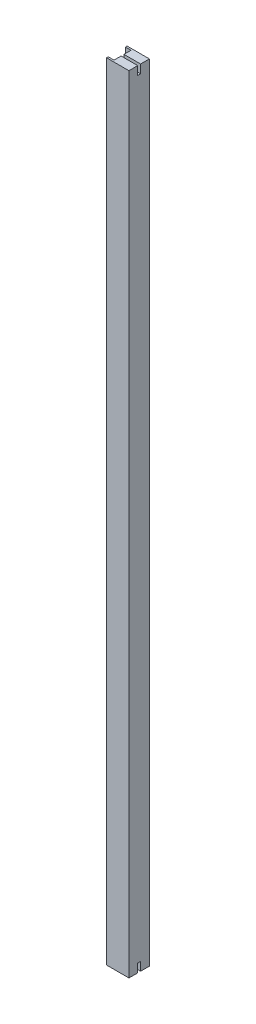
ISO-10303-21;
HEADER;
FILE_DESCRIPTION(('STEP AP214'),'2;1');
FILE_NAME('part.step','',(''),(''),'','','');
FILE_SCHEMA(('AUTOMOTIVE_DESIGN { 1 0 10303 214 1 1 1 1 }'));
ENDSEC;
DATA;
#1=APPLICATION_CONTEXT('core data for automotive mechanical design processes');
#2=APPLICATION_PROTOCOL_DEFINITION('international standard','automotive_design',2000,#1);
#3=PRODUCT_CONTEXT('',#1,'mechanical');
#4=PRODUCT('Part','Part','',(#3));
#5=PRODUCT_RELATED_PRODUCT_CATEGORY('part','',(#4));
#6=PRODUCT_DEFINITION_FORMATION('','',#4);
#7=PRODUCT_DEFINITION_CONTEXT('part definition',#1,'design');
#8=PRODUCT_DEFINITION('design','',#6,#7);
#9=PRODUCT_DEFINITION_SHAPE('','',#8);
#10=(LENGTH_UNIT() NAMED_UNIT(*) SI_UNIT(.MILLI.,.METRE.));
#11=(NAMED_UNIT(*) PLANE_ANGLE_UNIT() SI_UNIT($,.RADIAN.));
#12=(NAMED_UNIT(*) SI_UNIT($,.STERADIAN.) SOLID_ANGLE_UNIT());
#13=UNCERTAINTY_MEASURE_WITH_UNIT(LENGTH_MEASURE(1.E-05),#10,'distance_accuracy_value','');
#14=(GEOMETRIC_REPRESENTATION_CONTEXT(3) GLOBAL_UNCERTAINTY_ASSIGNED_CONTEXT((#13)) GLOBAL_UNIT_ASSIGNED_CONTEXT((#10,
#11,#12)) REPRESENTATION_CONTEXT('',''));
#15=CARTESIAN_POINT('',(0.,0.,0.));
#16=DIRECTION('',(0.,0.,1.));
#17=DIRECTION('',(1.,0.,0.));
#18=AXIS2_PLACEMENT_3D('',#15,#16,#17);
#19=CARTESIAN_POINT('',(0.,1383.55,0.));
#20=DIRECTION('',(0.,-1.,0.));
#21=DIRECTION('',(0.,0.,-1.));
#22=AXIS2_PLACEMENT_3D('',#19,#20,#21);
#23=PLANE('',#22);
#24=DIRECTION('',(0.,0.,1.));
#25=VECTOR('',#24,1.);
#26=CARTESIAN_POINT('',(10.,1383.55,-2.5));
#27=LINE('',#26,#25);
#28=CARTESIAN_POINT('',(10.,1383.55,-15.));
#29=VERTEX_POINT('',#28);
#30=CARTESIAN_POINT('',(10.,1383.55,-2.49999999999983));
#31=VERTEX_POINT('',#30);
#32=EDGE_CURVE('E145',#29,#31,#27,.T.);
#33=ORIENTED_EDGE('',*,*,#32,.T.);
#34=DIRECTION('',(1.,0.,0.));
#35=VECTOR('',#34,1.);
#36=CARTESIAN_POINT('',(0.,1383.55,-2.49999999999983));
#37=LINE('',#36,#35);
#38=CARTESIAN_POINT('',(39.2552066704881,1383.55,-2.49999999999983));
#39=VERTEX_POINT('',#38);
#40=EDGE_CURVE('E11',#31,#39,#37,.T.);
#41=ORIENTED_EDGE('',*,*,#40,.T.);
#42=DIRECTION('',(0.,0.,-1.));
#43=VECTOR('',#42,1.);
#44=CARTESIAN_POINT('',(39.2552066704881,1383.55,-18.));
#45=LINE('',#44,#43);
#46=CARTESIAN_POINT('',(39.2552066704881,1383.55,-18.));
#47=VERTEX_POINT('',#46);
#48=EDGE_CURVE('E127',#39,#47,#45,.T.);
#49=ORIENTED_EDGE('',*,*,#48,.T.);
#50=DIRECTION('',(-1.,0.,0.));
#51=VECTOR('',#50,1.);
#52=CARTESIAN_POINT('',(0.,1383.55,-18.));
#53=LINE('',#52,#51);
#54=CARTESIAN_POINT('',(0.,1383.55,-18.));
#55=VERTEX_POINT('',#54);
#56=EDGE_CURVE('E121',#47,#55,#53,.T.);
#57=ORIENTED_EDGE('',*,*,#56,.T.);
#58=DIRECTION('',(0.,0.,1.));
#59=VECTOR('',#58,1.);
#60=CARTESIAN_POINT('',(0.,1383.55,-15.));
#61=LINE('',#60,#59);
#62=CARTESIAN_POINT('',(0.,1383.55,-15.));
#63=VERTEX_POINT('',#62);
#64=EDGE_CURVE('E124',#55,#63,#61,.T.);
#65=ORIENTED_EDGE('',*,*,#64,.T.);
#66=DIRECTION('',(1.,0.,0.));
#67=VECTOR('',#66,1.);
#68=CARTESIAN_POINT('',(10.,1383.55,-15.));
#69=LINE('',#68,#67);
#70=EDGE_CURVE('E52',#63,#29,#69,.T.);
#71=ORIENTED_EDGE('',*,*,#70,.T.);
#72=EDGE_LOOP('',(#33,#41,#49,#57,#65,#71));
#73=FACE_BOUND('',#72,.T.);
#74=ADVANCED_FACE('F35',(#73),#23,.F.);
#75=CARTESIAN_POINT('',(0.,0.,0.));
#76=DIRECTION('',(0.,-1.,0.));
#77=DIRECTION('',(0.,0.,-1.));
#78=AXIS2_PLACEMENT_3D('',#75,#76,#77);
#79=PLANE('',#78);
#80=DIRECTION('',(-1.,0.,0.));
#81=VECTOR('',#80,1.);
#82=CARTESIAN_POINT('',(0.,0.,2.5));
#83=LINE('',#82,#81);
#84=CARTESIAN_POINT('',(39.2552066704881,0.,2.5));
#85=VERTEX_POINT('',#84);
#86=CARTESIAN_POINT('',(10.,0.,2.5));
#87=VERTEX_POINT('',#86);
#88=EDGE_CURVE('E201',#85,#87,#83,.T.);
#89=ORIENTED_EDGE('',*,*,#88,.F.);
#90=DIRECTION('',(0.,0.,-1.));
#91=VECTOR('',#90,1.);
#92=CARTESIAN_POINT('',(39.2552066704881,0.,-18.));
#93=LINE('',#92,#91);
#94=CARTESIAN_POINT('',(39.2552066704881,0.,18.));
#95=VERTEX_POINT('',#94);
#96=EDGE_CURVE('E161',#95,#85,#93,.T.);
#97=ORIENTED_EDGE('',*,*,#96,.F.);
#98=DIRECTION('',(1.,0.,0.));
#99=VECTOR('',#98,1.);
#100=CARTESIAN_POINT('',(0.,0.,18.));
#101=LINE('',#100,#99);
#102=CARTESIAN_POINT('',(0.,0.,18.));
#103=VERTEX_POINT('',#102);
#104=EDGE_CURVE('E158',#103,#95,#101,.T.);
#105=ORIENTED_EDGE('',*,*,#104,.F.);
#106=DIRECTION('',(0.,0.,1.));
#107=VECTOR('',#106,1.);
#108=CARTESIAN_POINT('',(0.,0.,15.));
#109=LINE('',#108,#107);
#110=CARTESIAN_POINT('',(0.,0.,15.));
#111=VERTEX_POINT('',#110);
#112=EDGE_CURVE('E156',#111,#103,#109,.T.);
#113=ORIENTED_EDGE('',*,*,#112,.F.);
#114=DIRECTION('',(-1.,0.,0.));
#115=VECTOR('',#114,1.);
#116=CARTESIAN_POINT('',(10.,0.,15.));
#117=LINE('',#116,#115);
#118=CARTESIAN_POINT('',(10.,0.,15.));
#119=VERTEX_POINT('',#118);
#120=EDGE_CURVE('E153',#119,#111,#117,.T.);
#121=ORIENTED_EDGE('',*,*,#120,.F.);
#122=DIRECTION('',(0.,0.,1.));
#123=VECTOR('',#122,1.);
#124=CARTESIAN_POINT('',(10.,0.,2.5));
#125=LINE('',#124,#123);
#126=EDGE_CURVE('E151',#87,#119,#125,.T.);
#127=ORIENTED_EDGE('',*,*,#126,.F.);
#128=EDGE_LOOP('',(#89,#97,#105,#113,#121,#127));
#129=FACE_BOUND('',#128,.T.);
#130=ADVANCED_FACE('F357',(#129),#79,.T.);
#131=CARTESIAN_POINT('',(0.,1383.55,-2.5));
#132=DIRECTION('',(1.,0.,0.));
#133=DIRECTION('',(0.,0.,-1.));
#134=AXIS2_PLACEMENT_3D('',#131,#132,#133);
#135=PLANE('',#134);
#136=DIRECTION('',(0.,-1.,0.));
#137=VECTOR('',#136,1.);
#138=CARTESIAN_POINT('',(0.,1383.55,-2.5));
#139=LINE('',#138,#137);
#140=CARTESIAN_POINT('',(0.,1368.55,-2.49999999999983));
#141=VERTEX_POINT('',#140);
#142=CARTESIAN_POINT('',(0.,15.,-2.5));
#143=VERTEX_POINT('',#142);
#144=EDGE_CURVE('E150',#141,#143,#139,.T.);
#145=ORIENTED_EDGE('',*,*,#144,.T.);
#146=DIRECTION('',(0.,0.,1.));
#147=VECTOR('',#146,1.);
#148=CARTESIAN_POINT('',(0.,15.,2.5));
#149=LINE('',#148,#147);
#150=CARTESIAN_POINT('',(0.,15.,2.5));
#151=VERTEX_POINT('',#150);
#152=EDGE_CURVE('E284',#143,#151,#149,.T.);
#153=ORIENTED_EDGE('',*,*,#152,.T.);
#154=DIRECTION('',(0.,-1.,0.));
#155=VECTOR('',#154,1.);
#156=CARTESIAN_POINT('',(0.,1383.55,2.5));
#157=LINE('',#156,#155);
#158=CARTESIAN_POINT('',(0.,1368.55,2.49999999999983));
#159=VERTEX_POINT('',#158);
#160=EDGE_CURVE('E196',#159,#151,#157,.T.);
#161=ORIENTED_EDGE('',*,*,#160,.F.);
#162=DIRECTION('',(0.,0.,-1.));
#163=VECTOR('',#162,1.);
#164=CARTESIAN_POINT('',(0.,1368.55,2.49999999999983));
#165=LINE('',#164,#163);
#166=EDGE_CURVE('E247',#159,#141,#165,.T.);
#167=ORIENTED_EDGE('',*,*,#166,.T.);
#168=EDGE_LOOP('',(#145,#153,#161,#167));
#169=FACE_BOUND('',#168,.T.);
#170=ADVANCED_FACE('F37',(#169),#135,.F.);
#171=CARTESIAN_POINT('',(10.,1383.55,2.5));
#172=DIRECTION('',(0.,0.,-1.));
#173=DIRECTION('',(-1.,0.,0.));
#174=AXIS2_PLACEMENT_3D('',#171,#172,#173);
#175=PLANE('',#174);
#176=ORIENTED_EDGE('',*,*,#160,.T.);
#177=DIRECTION('',(1.,0.,0.));
#178=VECTOR('',#177,1.);
#179=CARTESIAN_POINT('',(0.,15.,2.5));
#180=LINE('',#179,#178);
#181=CARTESIAN_POINT('',(10.,15.,2.5));
#182=VERTEX_POINT('',#181);
#183=EDGE_CURVE('E260',#151,#182,#180,.T.);
#184=ORIENTED_EDGE('',*,*,#183,.T.);
#185=DIRECTION('',(0.,-1.,0.));
#186=VECTOR('',#185,1.);
#187=CARTESIAN_POINT('',(10.,1383.55,2.5));
#188=LINE('',#187,#186);
#189=CARTESIAN_POINT('',(10.,1368.55,2.49999999999983));
#190=VERTEX_POINT('',#189);
#191=EDGE_CURVE('E194',#190,#182,#188,.T.);
#192=ORIENTED_EDGE('',*,*,#191,.F.);
#193=DIRECTION('',(1.,0.,0.));
#194=VECTOR('',#193,1.);
#195=CARTESIAN_POINT('',(0.,1368.55,2.49999999999983));
#196=LINE('',#195,#194);
#197=EDGE_CURVE('E257',#159,#190,#196,.T.);
#198=ORIENTED_EDGE('',*,*,#197,.F.);
#199=EDGE_LOOP('',(#176,#184,#192,#198));
#200=FACE_BOUND('',#199,.T.);
#201=ADVANCED_FACE('F397',(#200),#175,.F.);
#202=CARTESIAN_POINT('',(10.,1383.55,2.5));
#203=DIRECTION('',(1.,0.,0.));
#204=DIRECTION('',(0.,0.,-1.));
#205=AXIS2_PLACEMENT_3D('',#202,#203,#204);
#206=PLANE('',#205);
#207=ORIENTED_EDGE('',*,*,#126,.T.);
#208=DIRECTION('',(0.,-1.,0.));
#209=VECTOR('',#208,1.);
#210=CARTESIAN_POINT('',(10.,1383.55,15.));
#211=LINE('',#210,#209);
#212=CARTESIAN_POINT('',(10.,1383.55,15.));
#213=VERTEX_POINT('',#212);
#214=EDGE_CURVE('E191',#213,#119,#211,.T.);
#215=ORIENTED_EDGE('',*,*,#214,.F.);
#216=DIRECTION('',(0.,0.,1.));
#217=VECTOR('',#216,1.);
#218=CARTESIAN_POINT('',(10.,1383.55,2.5));
#219=LINE('',#218,#217);
#220=CARTESIAN_POINT('',(10.,1383.55,2.5));
#221=VERTEX_POINT('',#220);
#222=EDGE_CURVE('E171',#221,#213,#219,.T.);
#223=ORIENTED_EDGE('',*,*,#222,.F.);
#224=EDGE_CURVE('E101',#221,#190,#188,.T.);
#225=ORIENTED_EDGE('',*,*,#224,.T.);
#226=ORIENTED_EDGE('',*,*,#191,.T.);
#227=DIRECTION('',(0.,-1.,0.));
#228=VECTOR('',#227,1.);
#229=CARTESIAN_POINT('',(10.,1383.55,2.5));
#230=LINE('',#229,#228);
#231=EDGE_CURVE('E154',#182,#87,#230,.T.);
#232=ORIENTED_EDGE('',*,*,#231,.T.);
#233=EDGE_LOOP('',(#207,#215,#223,#225,#226,#232));
#234=FACE_BOUND('',#233,.T.);
#235=ADVANCED_FACE('F213',(#234),#206,.F.);
#236=CARTESIAN_POINT('',(10.,1383.55,15.));
#237=DIRECTION('',(0.,0.,1.));
#238=DIRECTION('',(1.,0.,0.));
#239=AXIS2_PLACEMENT_3D('',#236,#237,#238);
#240=PLANE('',#239);
#241=ORIENTED_EDGE('',*,*,#120,.T.);
#242=DIRECTION('',(0.,-1.,0.));
#243=VECTOR('',#242,1.);
#244=CARTESIAN_POINT('',(0.,1383.55,15.));
#245=LINE('',#244,#243);
#246=CARTESIAN_POINT('',(0.,1383.55,15.));
#247=VERTEX_POINT('',#246);
#248=EDGE_CURVE('E188',#247,#111,#245,.T.);
#249=ORIENTED_EDGE('',*,*,#248,.F.);
#250=DIRECTION('',(-1.,0.,0.));
#251=VECTOR('',#250,1.);
#252=CARTESIAN_POINT('',(10.,1383.55,15.));
#253=LINE('',#252,#251);
#254=EDGE_CURVE('E217',#213,#247,#253,.T.);
#255=ORIENTED_EDGE('',*,*,#254,.F.);
#256=ORIENTED_EDGE('',*,*,#214,.T.);
#257=EDGE_LOOP('',(#241,#249,#255,#256));
#258=FACE_BOUND('',#257,.T.);
#259=ADVANCED_FACE('F391',(#258),#240,.F.);
#260=CARTESIAN_POINT('',(0.,1383.55,15.));
#261=DIRECTION('',(1.,0.,0.));
#262=DIRECTION('',(0.,0.,-1.));
#263=AXIS2_PLACEMENT_3D('',#260,#261,#262);
#264=PLANE('',#263);
#265=ORIENTED_EDGE('',*,*,#112,.T.);
#266=DIRECTION('',(0.,-1.,0.));
#267=VECTOR('',#266,1.);
#268=CARTESIAN_POINT('',(0.,1383.55,18.));
#269=LINE('',#268,#267);
#270=CARTESIAN_POINT('',(0.,1383.55,18.));
#271=VERTEX_POINT('',#270);
#272=EDGE_CURVE('E185',#271,#103,#269,.T.);
#273=ORIENTED_EDGE('',*,*,#272,.F.);
#274=DIRECTION('',(0.,0.,1.));
#275=VECTOR('',#274,1.);
#276=CARTESIAN_POINT('',(0.,1383.55,15.));
#277=LINE('',#276,#275);
#278=EDGE_CURVE('E219',#247,#271,#277,.T.);
#279=ORIENTED_EDGE('',*,*,#278,.F.);
#280=ORIENTED_EDGE('',*,*,#248,.T.);
#281=EDGE_LOOP('',(#265,#273,#279,#280));
#282=FACE_BOUND('',#281,.T.);
#283=ADVANCED_FACE('F388',(#282),#264,.F.);
#284=CARTESIAN_POINT('',(0.,1383.55,18.));
#285=DIRECTION('',(0.,0.,-1.));
#286=DIRECTION('',(-1.,0.,0.));
#287=AXIS2_PLACEMENT_3D('',#284,#285,#286);
#288=PLANE('',#287);
#289=ORIENTED_EDGE('',*,*,#104,.T.);
#290=DIRECTION('',(0.,-1.,0.));
#291=VECTOR('',#290,1.);
#292=CARTESIAN_POINT('',(39.2552066704881,1383.55,18.));
#293=LINE('',#292,#291);
#294=CARTESIAN_POINT('',(39.2552066704881,1383.55,18.));
#295=VERTEX_POINT('',#294);
#296=EDGE_CURVE('E182',#295,#95,#293,.T.);
#297=ORIENTED_EDGE('',*,*,#296,.F.);
#298=DIRECTION('',(1.,0.,0.));
#299=VECTOR('',#298,1.);
#300=CARTESIAN_POINT('',(0.,1383.55,18.));
#301=LINE('',#300,#299);
#302=EDGE_CURVE('E225',#271,#295,#301,.T.);
#303=ORIENTED_EDGE('',*,*,#302,.F.);
#304=ORIENTED_EDGE('',*,*,#272,.T.);
#305=EDGE_LOOP('',(#289,#297,#303,#304));
#306=FACE_BOUND('',#305,.T.);
#307=ADVANCED_FACE('F231',(#306),#288,.F.);
#308=CARTESIAN_POINT('',(39.2552066704881,1383.55,-18.));
#309=DIRECTION('',(-1.,0.,0.));
#310=DIRECTION('',(0.,0.,1.));
#311=AXIS2_PLACEMENT_3D('',#308,#309,#310);
#312=PLANE('',#311);
#313=ORIENTED_EDGE('',*,*,#96,.T.);
#314=DIRECTION('',(0.,-1.,0.));
#315=VECTOR('',#314,1.);
#316=CARTESIAN_POINT('',(39.2552066704881,0.,2.5));
#317=LINE('',#316,#315);
#318=CARTESIAN_POINT('',(39.2552066704881,15.,2.5));
#319=VERTEX_POINT('',#318);
#320=EDGE_CURVE('E255',#319,#85,#317,.T.);
#321=ORIENTED_EDGE('',*,*,#320,.F.);
#322=DIRECTION('',(0.,0.,1.));
#323=VECTOR('',#322,1.);
#324=CARTESIAN_POINT('',(39.2552066704881,15.,2.5));
#325=LINE('',#324,#323);
#326=CARTESIAN_POINT('',(39.2552066704881,15.,-2.5));
#327=VERTEX_POINT('',#326);
#328=EDGE_CURVE('E276',#327,#319,#325,.T.);
#329=ORIENTED_EDGE('',*,*,#328,.F.);
#330=DIRECTION('',(0.,1.,0.));
#331=VECTOR('',#330,1.);
#332=CARTESIAN_POINT('',(39.2552066704881,0.,-2.5));
#333=LINE('',#332,#331);
#334=CARTESIAN_POINT('',(39.2552066704881,0.,-2.5));
#335=VERTEX_POINT('',#334);
#336=EDGE_CURVE('E293',#335,#327,#333,.T.);
#337=ORIENTED_EDGE('',*,*,#336,.F.);
#338=CARTESIAN_POINT('',(39.2552066704881,0.,-18.));
#339=VERTEX_POINT('',#338);
#340=EDGE_CURVE('E160',#335,#339,#93,.T.);
#341=ORIENTED_EDGE('',*,*,#340,.T.);
#342=DIRECTION('',(0.,-1.,0.));
#343=VECTOR('',#342,1.);
#344=CARTESIAN_POINT('',(39.2552066704881,1383.55,-18.));
#345=LINE('',#344,#343);
#346=EDGE_CURVE('E140',#47,#339,#345,.T.);
#347=ORIENTED_EDGE('',*,*,#346,.F.);
#348=ORIENTED_EDGE('',*,*,#48,.F.);
#349=DIRECTION('',(0.,1.,0.));
#350=VECTOR('',#349,1.);
#351=CARTESIAN_POINT('',(39.2552066704881,1383.55,-2.49999999999983));
#352=LINE('',#351,#350);
#353=CARTESIAN_POINT('',(39.2552066704881,1368.55,-2.49999999999983));
#354=VERTEX_POINT('',#353);
#355=EDGE_CURVE('E244',#354,#39,#352,.T.);
#356=ORIENTED_EDGE('',*,*,#355,.F.);
#357=DIRECTION('',(0.,0.,-1.));
#358=VECTOR('',#357,1.);
#359=CARTESIAN_POINT('',(39.2552066704881,1368.55,2.49999999999983));
#360=LINE('',#359,#358);
#361=CARTESIAN_POINT('',(39.2552066704881,1368.55,2.49999999999983));
#362=VERTEX_POINT('',#361);
#363=EDGE_CURVE('E241',#362,#354,#360,.T.);
#364=ORIENTED_EDGE('',*,*,#363,.F.);
#365=DIRECTION('',(0.,-1.,0.));
#366=VECTOR('',#365,1.);
#367=CARTESIAN_POINT('',(39.2552066704881,1383.55,2.49999999999983));
#368=LINE('',#367,#366);
#369=CARTESIAN_POINT('',(39.2552066704881,1383.55,2.49999999999983));
#370=VERTEX_POINT('',#369);
#371=EDGE_CURVE('E237',#370,#362,#368,.T.);
#372=ORIENTED_EDGE('',*,*,#371,.F.);
#373=EDGE_CURVE('E131',#295,#370,#45,.T.);
#374=ORIENTED_EDGE('',*,*,#373,.F.);
#375=ORIENTED_EDGE('',*,*,#296,.T.);
#376=EDGE_LOOP('',(#313,#321,#329,#337,#341,#347,#348,#356,#364,#372,#374,#375));
#377=FACE_BOUND('',#376,.T.);
#378=ADVANCED_FACE('F235',(#377),#312,.F.);
#379=CARTESIAN_POINT('',(0.,1383.55,-18.));
#380=DIRECTION('',(0.,0.,1.));
#381=DIRECTION('',(1.,0.,0.));
#382=AXIS2_PLACEMENT_3D('',#379,#380,#381);
#383=PLANE('',#382);
#384=DIRECTION('',(-1.,0.,0.));
#385=VECTOR('',#384,1.);
#386=CARTESIAN_POINT('',(0.,0.,-18.));
#387=LINE('',#386,#385);
#388=CARTESIAN_POINT('',(0.,0.,-18.));
#389=VERTEX_POINT('',#388);
#390=EDGE_CURVE('E137',#339,#389,#387,.T.);
#391=ORIENTED_EDGE('',*,*,#390,.T.);
#392=DIRECTION('',(0.,-1.,0.));
#393=VECTOR('',#392,1.);
#394=CARTESIAN_POINT('',(0.,1383.55,-18.));
#395=LINE('',#394,#393);
#396=EDGE_CURVE('E134',#55,#389,#395,.T.);
#397=ORIENTED_EDGE('',*,*,#396,.F.);
#398=ORIENTED_EDGE('',*,*,#56,.F.);
#399=ORIENTED_EDGE('',*,*,#346,.T.);
#400=EDGE_LOOP('',(#391,#397,#398,#399));
#401=FACE_BOUND('',#400,.T.);
#402=ADVANCED_FACE('F135',(#401),#383,.F.);
#403=CARTESIAN_POINT('',(0.,1383.55,-15.));
#404=DIRECTION('',(1.,0.,0.));
#405=DIRECTION('',(0.,0.,-1.));
#406=AXIS2_PLACEMENT_3D('',#403,#404,#405);
#407=PLANE('',#406);
#408=DIRECTION('',(0.,0.,1.));
#409=VECTOR('',#408,1.);
#410=CARTESIAN_POINT('',(0.,0.,-15.));
#411=LINE('',#410,#409);
#412=CARTESIAN_POINT('',(0.,0.,-15.));
#413=VERTEX_POINT('',#412);
#414=EDGE_CURVE('E165',#389,#413,#411,.T.);
#415=ORIENTED_EDGE('',*,*,#414,.T.);
#416=DIRECTION('',(0.,-1.,0.));
#417=VECTOR('',#416,1.);
#418=CARTESIAN_POINT('',(0.,1383.55,-15.));
#419=LINE('',#418,#417);
#420=EDGE_CURVE('E141',#63,#413,#419,.T.);
#421=ORIENTED_EDGE('',*,*,#420,.F.);
#422=ORIENTED_EDGE('',*,*,#64,.F.);
#423=ORIENTED_EDGE('',*,*,#396,.T.);
#424=EDGE_LOOP('',(#415,#421,#422,#423));
#425=FACE_BOUND('',#424,.T.);
#426=ADVANCED_FACE('F143',(#425),#407,.F.);
#427=CARTESIAN_POINT('',(10.,1383.55,-15.));
#428=DIRECTION('',(0.,0.,-1.));
#429=DIRECTION('',(-1.,0.,0.));
#430=AXIS2_PLACEMENT_3D('',#427,#428,#429);
#431=PLANE('',#430);
#432=DIRECTION('',(1.,0.,0.));
#433=VECTOR('',#432,1.);
#434=CARTESIAN_POINT('',(10.,0.,-15.));
#435=LINE('',#434,#433);
#436=CARTESIAN_POINT('',(10.,0.,-15.));
#437=VERTEX_POINT('',#436);
#438=EDGE_CURVE('E84',#413,#437,#435,.T.);
#439=ORIENTED_EDGE('',*,*,#438,.T.);
#440=DIRECTION('',(0.,-1.,0.));
#441=VECTOR('',#440,1.);
#442=CARTESIAN_POINT('',(10.,1383.55,-15.));
#443=LINE('',#442,#441);
#444=EDGE_CURVE('E178',#29,#437,#443,.T.);
#445=ORIENTED_EDGE('',*,*,#444,.F.);
#446=ORIENTED_EDGE('',*,*,#70,.F.);
#447=ORIENTED_EDGE('',*,*,#420,.T.);
#448=EDGE_LOOP('',(#439,#445,#446,#447));
#449=FACE_BOUND('',#448,.T.);
#450=ADVANCED_FACE('F375',(#449),#431,.F.);
#451=CARTESIAN_POINT('',(10.,1383.55,-2.5));
#452=DIRECTION('',(1.,0.,0.));
#453=DIRECTION('',(0.,0.,-1.));
#454=AXIS2_PLACEMENT_3D('',#451,#452,#453);
#455=PLANE('',#454);
#456=DIRECTION('',(0.,0.,1.));
#457=VECTOR('',#456,1.);
#458=CARTESIAN_POINT('',(10.,0.,-2.5));
#459=LINE('',#458,#457);
#460=CARTESIAN_POINT('',(10.,0.,-2.5));
#461=VERTEX_POINT('',#460);
#462=EDGE_CURVE('E168',#437,#461,#459,.T.);
#463=ORIENTED_EDGE('',*,*,#462,.T.);
#464=DIRECTION('',(0.,1.,0.));
#465=VECTOR('',#464,1.);
#466=CARTESIAN_POINT('',(10.,1383.55,-2.5));
#467=LINE('',#466,#465);
#468=CARTESIAN_POINT('',(10.,15.,-2.5));
#469=VERTEX_POINT('',#468);
#470=EDGE_CURVE('E92',#461,#469,#467,.T.);
#471=ORIENTED_EDGE('',*,*,#470,.T.);
#472=DIRECTION('',(0.,-1.,0.));
#473=VECTOR('',#472,1.);
#474=CARTESIAN_POINT('',(10.,1383.55,-2.5));
#475=LINE('',#474,#473);
#476=CARTESIAN_POINT('',(10.,1368.55,-2.49999999999983));
#477=VERTEX_POINT('',#476);
#478=EDGE_CURVE('E174',#477,#469,#475,.T.);
#479=ORIENTED_EDGE('',*,*,#478,.F.);
#480=EDGE_CURVE('E175',#31,#477,#475,.T.);
#481=ORIENTED_EDGE('',*,*,#480,.F.);
#482=ORIENTED_EDGE('',*,*,#32,.F.);
#483=ORIENTED_EDGE('',*,*,#444,.T.);
#484=EDGE_LOOP('',(#463,#471,#479,#481,#482,#483));
#485=FACE_BOUND('',#484,.T.);
#486=ADVANCED_FACE('F338',(#485),#455,.F.);
#487=CARTESIAN_POINT('',(10.,1383.55,-2.5));
#488=DIRECTION('',(0.,0.,1.));
#489=DIRECTION('',(1.,0.,0.));
#490=AXIS2_PLACEMENT_3D('',#487,#488,#489);
#491=PLANE('',#490);
#492=ORIENTED_EDGE('',*,*,#478,.T.);
#493=DIRECTION('',(1.,0.,0.));
#494=VECTOR('',#493,1.);
#495=CARTESIAN_POINT('',(0.,15.,-2.5));
#496=LINE('',#495,#494);
#497=EDGE_CURVE('E274',#143,#469,#496,.T.);
#498=ORIENTED_EDGE('',*,*,#497,.F.);
#499=ORIENTED_EDGE('',*,*,#144,.F.);
#500=DIRECTION('',(1.,0.,0.));
#501=VECTOR('',#500,1.);
#502=CARTESIAN_POINT('',(0.,1368.55,-2.49999999999983));
#503=LINE('',#502,#501);
#504=EDGE_CURVE('E252',#141,#477,#503,.T.);
#505=ORIENTED_EDGE('',*,*,#504,.T.);
#506=EDGE_LOOP('',(#492,#498,#499,#505));
#507=FACE_BOUND('',#506,.T.);
#508=ADVANCED_FACE('F340',(#507),#491,.F.);
#509=ORIENTED_EDGE('',*,*,#373,.T.);
#510=DIRECTION('',(-1.,0.,0.));
#511=VECTOR('',#510,1.);
#512=CARTESIAN_POINT('',(0.,1383.55,2.49999999999983));
#513=LINE('',#512,#511);
#514=EDGE_CURVE('E44',#370,#221,#513,.T.);
#515=ORIENTED_EDGE('',*,*,#514,.T.);
#516=ORIENTED_EDGE('',*,*,#222,.T.);
#517=ORIENTED_EDGE('',*,*,#254,.T.);
#518=ORIENTED_EDGE('',*,*,#278,.T.);
#519=ORIENTED_EDGE('',*,*,#302,.T.);
#520=EDGE_LOOP('',(#509,#515,#516,#517,#518,#519));
#521=FACE_BOUND('',#520,.T.);
#522=ADVANCED_FACE('F206',(#521),#23,.F.);
#523=DIRECTION('',(1.,0.,0.));
#524=VECTOR('',#523,1.);
#525=CARTESIAN_POINT('',(0.,0.,-2.5));
#526=LINE('',#525,#524);
#527=EDGE_CURVE('E199',#461,#335,#526,.T.);
#528=ORIENTED_EDGE('',*,*,#527,.F.);
#529=ORIENTED_EDGE('',*,*,#462,.F.);
#530=ORIENTED_EDGE('',*,*,#438,.F.);
#531=ORIENTED_EDGE('',*,*,#414,.F.);
#532=ORIENTED_EDGE('',*,*,#390,.F.);
#533=ORIENTED_EDGE('',*,*,#340,.F.);
#534=EDGE_LOOP('',(#528,#529,#530,#531,#532,#533));
#535=FACE_BOUND('',#534,.T.);
#536=ADVANCED_FACE('F363',(#535),#79,.T.);
#537=CARTESIAN_POINT('',(0.,0.,2.5));
#538=DIRECTION('',(0.,0.,1.));
#539=DIRECTION('',(1.,0.,0.));
#540=AXIS2_PLACEMENT_3D('',#537,#538,#539);
#541=PLANE('',#540);
#542=EDGE_CURVE('E267',#182,#319,#180,.T.);
#543=ORIENTED_EDGE('',*,*,#542,.T.);
#544=ORIENTED_EDGE('',*,*,#320,.T.);
#545=ORIENTED_EDGE('',*,*,#88,.T.);
#546=ORIENTED_EDGE('',*,*,#231,.F.);
#547=EDGE_LOOP('',(#543,#544,#545,#546));
#548=FACE_BOUND('',#547,.T.);
#549=ADVANCED_FACE('F369',(#548),#541,.F.);
#550=CARTESIAN_POINT('',(0.,0.,-2.5));
#551=DIRECTION('',(0.,0.,-1.));
#552=DIRECTION('',(-1.,0.,0.));
#553=AXIS2_PLACEMENT_3D('',#550,#551,#552);
#554=PLANE('',#553);
#555=ORIENTED_EDGE('',*,*,#527,.T.);
#556=ORIENTED_EDGE('',*,*,#336,.T.);
#557=EDGE_CURVE('E279',#469,#327,#496,.T.);
#558=ORIENTED_EDGE('',*,*,#557,.F.);
#559=ORIENTED_EDGE('',*,*,#470,.F.);
#560=EDGE_LOOP('',(#555,#556,#558,#559));
#561=FACE_BOUND('',#560,.T.);
#562=ADVANCED_FACE('F298',(#561),#554,.F.);
#563=CARTESIAN_POINT('',(0.,15.,2.5));
#564=DIRECTION('',(0.,1.,0.));
#565=DIRECTION('',(0.,0.,1.));
#566=AXIS2_PLACEMENT_3D('',#563,#564,#565);
#567=PLANE('',#566);
#568=ORIENTED_EDGE('',*,*,#328,.T.);
#569=ORIENTED_EDGE('',*,*,#542,.F.);
#570=ORIENTED_EDGE('',*,*,#183,.F.);
#571=ORIENTED_EDGE('',*,*,#152,.F.);
#572=ORIENTED_EDGE('',*,*,#497,.T.);
#573=ORIENTED_EDGE('',*,*,#557,.T.);
#574=EDGE_LOOP('',(#568,#569,#570,#571,#572,#573));
#575=FACE_BOUND('',#574,.T.);
#576=ADVANCED_FACE('F305',(#575),#567,.F.);
#577=CARTESIAN_POINT('',(0.,1383.55,-2.49999999999983));
#578=DIRECTION('',(0.,0.,-1.));
#579=DIRECTION('',(0.,1.,0.));
#580=AXIS2_PLACEMENT_3D('',#577,#578,#579);
#581=PLANE('',#580);
#582=EDGE_CURVE('E256',#477,#354,#503,.T.);
#583=ORIENTED_EDGE('',*,*,#582,.T.);
#584=ORIENTED_EDGE('',*,*,#355,.T.);
#585=ORIENTED_EDGE('',*,*,#40,.F.);
#586=ORIENTED_EDGE('',*,*,#480,.T.);
#587=EDGE_LOOP('',(#583,#584,#585,#586));
#588=FACE_BOUND('',#587,.T.);
#589=ADVANCED_FACE('F336',(#588),#581,.F.);
#590=CARTESIAN_POINT('',(0.,1383.55,2.49999999999983));
#591=DIRECTION('',(0.,0.,1.));
#592=DIRECTION('',(0.,-1.,0.));
#593=AXIS2_PLACEMENT_3D('',#590,#591,#592);
#594=PLANE('',#593);
#595=ORIENTED_EDGE('',*,*,#514,.F.);
#596=ORIENTED_EDGE('',*,*,#371,.T.);
#597=EDGE_CURVE('E259',#190,#362,#196,.T.);
#598=ORIENTED_EDGE('',*,*,#597,.F.);
#599=ORIENTED_EDGE('',*,*,#224,.F.);
#600=EDGE_LOOP('',(#595,#596,#598,#599));
#601=FACE_BOUND('',#600,.T.);
#602=ADVANCED_FACE('F346',(#601),#594,.F.);
#603=CARTESIAN_POINT('',(0.,1368.55,2.49999999999983));
#604=DIRECTION('',(0.,-1.,0.));
#605=DIRECTION('',(0.,0.,-1.));
#606=AXIS2_PLACEMENT_3D('',#603,#604,#605);
#607=PLANE('',#606);
#608=ORIENTED_EDGE('',*,*,#363,.T.);
#609=ORIENTED_EDGE('',*,*,#582,.F.);
#610=ORIENTED_EDGE('',*,*,#504,.F.);
#611=ORIENTED_EDGE('',*,*,#166,.F.);
#612=ORIENTED_EDGE('',*,*,#197,.T.);
#613=ORIENTED_EDGE('',*,*,#597,.T.);
#614=EDGE_LOOP('',(#608,#609,#610,#611,#612,#613));
#615=FACE_BOUND('',#614,.T.);
#616=ADVANCED_FACE('F344',(#615),#607,.F.);
#617=CLOSED_SHELL('',(#74,#130,#170,#201,#235,#259,#283,#307,#378,#402,#426,#450,#486,#508,#522,
#536,#549,#562,#576,#589,#602,#616));
#618=MANIFOLD_SOLID_BREP('B2',#617);
#619=ADVANCED_BREP_SHAPE_REPRESENTATION('',(#18,#618),#14);
#620=SHAPE_DEFINITION_REPRESENTATION(#9,#619);
ENDSEC;
END-ISO-10303-21;
